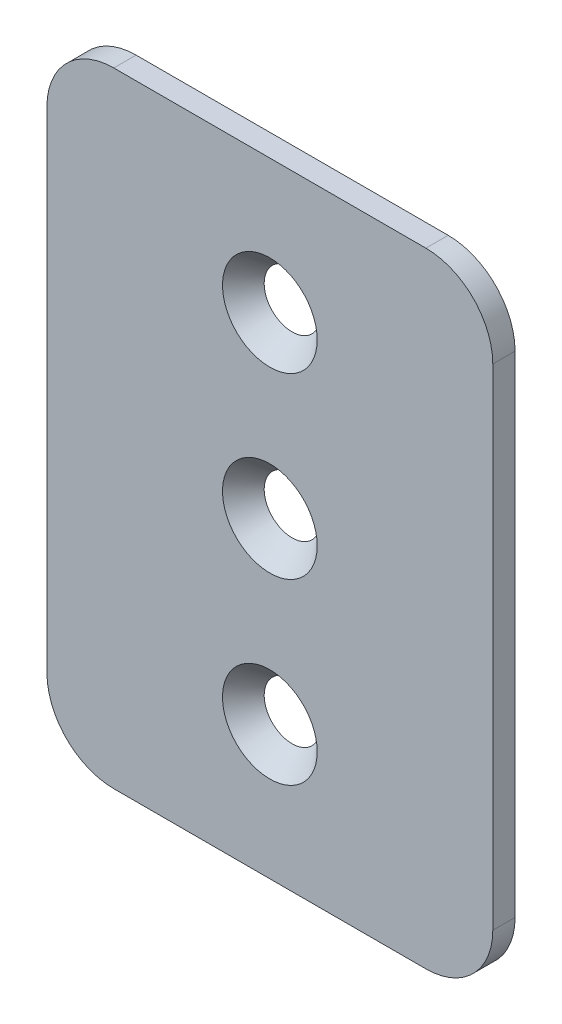
ISO-10303-21;
HEADER;
FILE_DESCRIPTION(('STEP AP214'),'2;1');
FILE_NAME('part.step','',(''),(''),'','','');
FILE_SCHEMA(('AUTOMOTIVE_DESIGN { 1 0 10303 214 1 1 1 1 }'));
ENDSEC;
DATA;
#1=APPLICATION_CONTEXT('core data for automotive mechanical design processes');
#2=APPLICATION_PROTOCOL_DEFINITION('international standard','automotive_design',2000,#1);
#3=PRODUCT_CONTEXT('',#1,'mechanical');
#4=PRODUCT('Part','Part','',(#3));
#5=PRODUCT_RELATED_PRODUCT_CATEGORY('part','',(#4));
#6=PRODUCT_DEFINITION_FORMATION('','',#4);
#7=PRODUCT_DEFINITION_CONTEXT('part definition',#1,'design');
#8=PRODUCT_DEFINITION('design','',#6,#7);
#9=PRODUCT_DEFINITION_SHAPE('','',#8);
#10=(LENGTH_UNIT() NAMED_UNIT(*) SI_UNIT(.MILLI.,.METRE.));
#11=(NAMED_UNIT(*) PLANE_ANGLE_UNIT() SI_UNIT($,.RADIAN.));
#12=(NAMED_UNIT(*) SI_UNIT($,.STERADIAN.) SOLID_ANGLE_UNIT());
#13=UNCERTAINTY_MEASURE_WITH_UNIT(LENGTH_MEASURE(1.E-05),#10,'distance_accuracy_value','');
#14=(GEOMETRIC_REPRESENTATION_CONTEXT(3) GLOBAL_UNCERTAINTY_ASSIGNED_CONTEXT((#13)) GLOBAL_UNIT_ASSIGNED_CONTEXT((#10,
#11,#12)) REPRESENTATION_CONTEXT('',''));
#15=CARTESIAN_POINT('',(0.,0.,0.));
#16=DIRECTION('',(0.,0.,1.));
#17=DIRECTION('',(1.,0.,0.));
#18=AXIS2_PLACEMENT_3D('',#15,#16,#17);
#19=CARTESIAN_POINT('',(22.225,34.925,0.));
#20=DIRECTION('',(0.,0.,-1.));
#21=DIRECTION('',(-1.,0.,0.));
#22=AXIS2_PLACEMENT_3D('',#19,#20,#21);
#23=PLANE('',#22);
#24=CARTESIAN_POINT('',(0.,25.4,0.));
#25=DIRECTION('',(0.,0.,-1.));
#26=DIRECTION('',(-1.,0.,0.));
#27=AXIS2_PLACEMENT_3D('',#24,#25,#26);
#28=CIRCLE('',#27,3.98371460743348);
#29=CARTESIAN_POINT('',(-3.98371460743349,25.4,0.));
#30=VERTEX_POINT('',#29);
#31=EDGE_CURVE('E226',#30,#30,#28,.T.);
#32=ORIENTED_EDGE('',*,*,#31,.F.);
#33=EDGE_LOOP('',(#32));
#34=FACE_BOUND('',#33,.T.);
#35=CARTESIAN_POINT('',(0.,-25.4,0.));
#36=DIRECTION('',(0.,0.,-1.));
#37=DIRECTION('',(-1.,0.,0.));
#38=AXIS2_PLACEMENT_3D('',#35,#36,#37);
#39=CIRCLE('',#38,3.98371460743348);
#40=CARTESIAN_POINT('',(-3.98371460743347,-25.4,0.));
#41=VERTEX_POINT('',#40);
#42=EDGE_CURVE('E137',#41,#41,#39,.T.);
#43=ORIENTED_EDGE('',*,*,#42,.F.);
#44=EDGE_LOOP('',(#43));
#45=FACE_BOUND('',#44,.T.);
#46=CARTESIAN_POINT('',(22.225,34.925,0.));
#47=DIRECTION('',(0.,0.,1.));
#48=DIRECTION('',(-1.,0.,0.));
#49=AXIS2_PLACEMENT_3D('',#46,#47,#48);
#50=CIRCLE('',#49,9.525);
#51=CARTESIAN_POINT('',(31.75,34.925,0.));
#52=VERTEX_POINT('',#51);
#53=CARTESIAN_POINT('',(22.225,44.45,0.));
#54=VERTEX_POINT('',#53);
#55=EDGE_CURVE('E133',#52,#54,#50,.T.);
#56=ORIENTED_EDGE('',*,*,#55,.F.);
#57=DIRECTION('',(0.,1.,0.));
#58=VECTOR('',#57,1.);
#59=CARTESIAN_POINT('',(31.75,34.925,0.));
#60=LINE('',#59,#58);
#61=CARTESIAN_POINT('',(31.75,-34.925,0.));
#62=VERTEX_POINT('',#61);
#63=EDGE_CURVE('E87',#62,#52,#60,.T.);
#64=ORIENTED_EDGE('',*,*,#63,.F.);
#65=CARTESIAN_POINT('',(22.225,-34.925,0.));
#66=DIRECTION('',(0.,0.,1.));
#67=DIRECTION('',(1.,0.,0.));
#68=AXIS2_PLACEMENT_3D('',#65,#66,#67);
#69=CIRCLE('',#68,9.525);
#70=CARTESIAN_POINT('',(22.225,-44.45,0.));
#71=VERTEX_POINT('',#70);
#72=EDGE_CURVE('E81',#71,#62,#69,.T.);
#73=ORIENTED_EDGE('',*,*,#72,.F.);
#74=DIRECTION('',(1.,0.,0.));
#75=VECTOR('',#74,1.);
#76=CARTESIAN_POINT('',(-22.225,-44.45,0.));
#77=LINE('',#76,#75);
#78=CARTESIAN_POINT('',(-22.225,-44.45,0.));
#79=VERTEX_POINT('',#78);
#80=EDGE_CURVE('E123',#79,#71,#77,.T.);
#81=ORIENTED_EDGE('',*,*,#80,.F.);
#82=CARTESIAN_POINT('',(-22.225,-34.925,0.));
#83=DIRECTION('',(0.,0.,1.));
#84=DIRECTION('',(1.,0.,0.));
#85=AXIS2_PLACEMENT_3D('',#82,#83,#84);
#86=CIRCLE('',#85,9.525);
#87=CARTESIAN_POINT('',(-31.75,-34.925,0.));
#88=VERTEX_POINT('',#87);
#89=EDGE_CURVE('E143',#88,#79,#86,.T.);
#90=ORIENTED_EDGE('',*,*,#89,.F.);
#91=DIRECTION('',(0.,-1.,0.));
#92=VECTOR('',#91,1.);
#93=CARTESIAN_POINT('',(-31.75,34.925,0.));
#94=LINE('',#93,#92);
#95=CARTESIAN_POINT('',(-31.75,34.925,0.));
#96=VERTEX_POINT('',#95);
#97=EDGE_CURVE('E141',#96,#88,#94,.T.);
#98=ORIENTED_EDGE('',*,*,#97,.F.);
#99=CARTESIAN_POINT('',(-22.225,34.925,0.));
#100=DIRECTION('',(0.,0.,1.));
#101=DIRECTION('',(1.,0.,0.));
#102=AXIS2_PLACEMENT_3D('',#99,#100,#101);
#103=CIRCLE('',#102,9.525);
#104=CARTESIAN_POINT('',(-22.225,44.45,0.));
#105=VERTEX_POINT('',#104);
#106=EDGE_CURVE('E139',#105,#96,#103,.T.);
#107=ORIENTED_EDGE('',*,*,#106,.F.);
#108=DIRECTION('',(-1.,0.,0.));
#109=VECTOR('',#108,1.);
#110=CARTESIAN_POINT('',(-22.225,44.45,0.));
#111=LINE('',#110,#109);
#112=EDGE_CURVE('E136',#54,#105,#111,.T.);
#113=ORIENTED_EDGE('',*,*,#112,.F.);
#114=EDGE_LOOP('',(#56,#64,#73,#81,#90,#98,#107,#113));
#115=FACE_BOUND('',#114,.T.);
#116=CARTESIAN_POINT('',(0.,0.,0.));
#117=DIRECTION('',(0.,0.,-1.));
#118=DIRECTION('',(-1.,0.,0.));
#119=AXIS2_PLACEMENT_3D('',#116,#117,#118);
#120=CIRCLE('',#119,3.98371460743348);
#121=CARTESIAN_POINT('',(-3.98371460743347,0.,0.));
#122=VERTEX_POINT('',#121);
#123=EDGE_CURVE('E37',#122,#122,#120,.T.);
#124=ORIENTED_EDGE('',*,*,#123,.F.);
#125=EDGE_LOOP('',(#124));
#126=FACE_BOUND('',#125,.T.);
#127=ADVANCED_FACE('F33',(#34,#45,#115,#126),#23,.T.);
#128=CARTESIAN_POINT('',(22.225,34.925,3.175));
#129=DIRECTION('',(0.,0.,-1.));
#130=DIRECTION('',(-1.,0.,0.));
#131=AXIS2_PLACEMENT_3D('',#128,#129,#130);
#132=PLANE('',#131);
#133=CARTESIAN_POINT('',(0.,25.4,3.175));
#134=DIRECTION('',(0.,0.,1.));
#135=DIRECTION('',(1.,0.,0.));
#136=AXIS2_PLACEMENT_3D('',#133,#134,#135);
#137=CIRCLE('',#136,6.7437);
#138=CARTESIAN_POINT('',(6.74369999999999,25.4,3.175));
#139=VERTEX_POINT('',#138);
#140=EDGE_CURVE('E229',#139,#139,#137,.T.);
#141=ORIENTED_EDGE('',*,*,#140,.F.);
#142=EDGE_LOOP('',(#141));
#143=FACE_BOUND('',#142,.T.);
#144=CARTESIAN_POINT('',(0.,0.,3.175));
#145=DIRECTION('',(0.,0.,1.));
#146=DIRECTION('',(1.,0.,0.));
#147=AXIS2_PLACEMENT_3D('',#144,#145,#146);
#148=CIRCLE('',#147,6.7437);
#149=CARTESIAN_POINT('',(6.74370000000001,0.,3.175));
#150=VERTEX_POINT('',#149);
#151=EDGE_CURVE('E168',#150,#150,#148,.T.);
#152=ORIENTED_EDGE('',*,*,#151,.F.);
#153=EDGE_LOOP('',(#152));
#154=FACE_BOUND('',#153,.T.);
#155=CARTESIAN_POINT('',(22.225,34.925,3.175));
#156=DIRECTION('',(0.,0.,1.));
#157=DIRECTION('',(-1.,0.,0.));
#158=AXIS2_PLACEMENT_3D('',#155,#156,#157);
#159=CIRCLE('',#158,9.525);
#160=CARTESIAN_POINT('',(31.75,34.925,3.175));
#161=VERTEX_POINT('',#160);
#162=CARTESIAN_POINT('',(22.225,44.45,3.175));
#163=VERTEX_POINT('',#162);
#164=EDGE_CURVE('E148',#161,#163,#159,.T.);
#165=ORIENTED_EDGE('',*,*,#164,.T.);
#166=DIRECTION('',(-1.,0.,0.));
#167=VECTOR('',#166,1.);
#168=CARTESIAN_POINT('',(-22.225,44.45,3.175));
#169=LINE('',#168,#167);
#170=CARTESIAN_POINT('',(-22.225,44.45,3.175));
#171=VERTEX_POINT('',#170);
#172=EDGE_CURVE('E95',#163,#171,#169,.T.);
#173=ORIENTED_EDGE('',*,*,#172,.T.);
#174=CARTESIAN_POINT('',(-22.225,34.925,3.175));
#175=DIRECTION('',(0.,0.,1.));
#176=DIRECTION('',(1.,0.,0.));
#177=AXIS2_PLACEMENT_3D('',#174,#175,#176);
#178=CIRCLE('',#177,9.525);
#179=CARTESIAN_POINT('',(-31.75,34.925,3.175));
#180=VERTEX_POINT('',#179);
#181=EDGE_CURVE('E174',#171,#180,#178,.T.);
#182=ORIENTED_EDGE('',*,*,#181,.T.);
#183=DIRECTION('',(0.,-1.,0.));
#184=VECTOR('',#183,1.);
#185=CARTESIAN_POINT('',(-31.75,34.925,3.175));
#186=LINE('',#185,#184);
#187=CARTESIAN_POINT('',(-31.75,-34.925,3.175));
#188=VERTEX_POINT('',#187);
#189=EDGE_CURVE('E176',#180,#188,#186,.T.);
#190=ORIENTED_EDGE('',*,*,#189,.T.);
#191=CARTESIAN_POINT('',(-22.225,-34.925,3.175));
#192=DIRECTION('',(0.,0.,1.));
#193=DIRECTION('',(1.,0.,0.));
#194=AXIS2_PLACEMENT_3D('',#191,#192,#193);
#195=CIRCLE('',#194,9.525);
#196=CARTESIAN_POINT('',(-22.225,-44.45,3.175));
#197=VERTEX_POINT('',#196);
#198=EDGE_CURVE('E115',#188,#197,#195,.T.);
#199=ORIENTED_EDGE('',*,*,#198,.T.);
#200=DIRECTION('',(1.,0.,0.));
#201=VECTOR('',#200,1.);
#202=CARTESIAN_POINT('',(-22.225,-44.45,3.175));
#203=LINE('',#202,#201);
#204=CARTESIAN_POINT('',(22.225,-44.45,3.175));
#205=VERTEX_POINT('',#204);
#206=EDGE_CURVE('E108',#197,#205,#203,.T.);
#207=ORIENTED_EDGE('',*,*,#206,.T.);
#208=CARTESIAN_POINT('',(22.225,-34.925,3.175));
#209=DIRECTION('',(0.,0.,1.));
#210=DIRECTION('',(1.,0.,0.));
#211=AXIS2_PLACEMENT_3D('',#208,#209,#210);
#212=CIRCLE('',#211,9.525);
#213=CARTESIAN_POINT('',(31.75,-34.925,3.175));
#214=VERTEX_POINT('',#213);
#215=EDGE_CURVE('E113',#205,#214,#212,.T.);
#216=ORIENTED_EDGE('',*,*,#215,.T.);
#217=DIRECTION('',(0.,1.,0.));
#218=VECTOR('',#217,1.);
#219=CARTESIAN_POINT('',(31.75,34.925,3.175));
#220=LINE('',#219,#218);
#221=EDGE_CURVE('E52',#214,#161,#220,.T.);
#222=ORIENTED_EDGE('',*,*,#221,.T.);
#223=EDGE_LOOP('',(#165,#173,#182,#190,#199,#207,#216,#222));
#224=FACE_BOUND('',#223,.T.);
#225=CARTESIAN_POINT('',(0.,-25.4,3.175));
#226=DIRECTION('',(0.,0.,1.));
#227=DIRECTION('',(1.,0.,0.));
#228=AXIS2_PLACEMENT_3D('',#225,#226,#227);
#229=CIRCLE('',#228,6.7437);
#230=CARTESIAN_POINT('',(6.74370000000001,-25.4,3.175));
#231=VERTEX_POINT('',#230);
#232=EDGE_CURVE('E160',#231,#231,#229,.T.);
#233=ORIENTED_EDGE('',*,*,#232,.F.);
#234=EDGE_LOOP('',(#233));
#235=FACE_BOUND('',#234,.T.);
#236=ADVANCED_FACE('F110',(#143,#154,#224,#235),#132,.F.);
#237=CARTESIAN_POINT('',(22.225,34.925,3.175));
#238=DIRECTION('',(0.,0.,-1.));
#239=DIRECTION('',(-1.,0.,0.));
#240=AXIS2_PLACEMENT_3D('',#237,#238,#239);
#241=CYLINDRICAL_SURFACE('',#240,9.525);
#242=ORIENTED_EDGE('',*,*,#55,.T.);
#243=DIRECTION('',(0.,0.,-1.));
#244=VECTOR('',#243,1.);
#245=CARTESIAN_POINT('',(22.225,44.45,3.175));
#246=LINE('',#245,#244);
#247=EDGE_CURVE('E11',#163,#54,#246,.T.);
#248=ORIENTED_EDGE('',*,*,#247,.F.);
#249=ORIENTED_EDGE('',*,*,#164,.F.);
#250=DIRECTION('',(0.,0.,-1.));
#251=VECTOR('',#250,1.);
#252=CARTESIAN_POINT('',(31.75,34.925,3.175));
#253=LINE('',#252,#251);
#254=EDGE_CURVE('E129',#161,#52,#253,.T.);
#255=ORIENTED_EDGE('',*,*,#254,.T.);
#256=EDGE_LOOP('',(#242,#248,#249,#255));
#257=FACE_BOUND('',#256,.T.);
#258=ADVANCED_FACE('F35',(#257),#241,.T.);
#259=CARTESIAN_POINT('',(-22.225,44.45,3.175));
#260=DIRECTION('',(0.,-1.,0.));
#261=DIRECTION('',(0.,0.,-1.));
#262=AXIS2_PLACEMENT_3D('',#259,#260,#261);
#263=PLANE('',#262);
#264=ORIENTED_EDGE('',*,*,#112,.T.);
#265=DIRECTION('',(0.,0.,-1.));
#266=VECTOR('',#265,1.);
#267=CARTESIAN_POINT('',(-22.225,44.45,3.175));
#268=LINE('',#267,#266);
#269=EDGE_CURVE('E43',#171,#105,#268,.T.);
#270=ORIENTED_EDGE('',*,*,#269,.F.);
#271=ORIENTED_EDGE('',*,*,#172,.F.);
#272=ORIENTED_EDGE('',*,*,#247,.T.);
#273=EDGE_LOOP('',(#264,#270,#271,#272));
#274=FACE_BOUND('',#273,.T.);
#275=ADVANCED_FACE('F298',(#274),#263,.F.);
#276=CARTESIAN_POINT('',(-22.225,34.925,3.175));
#277=DIRECTION('',(0.,0.,-1.));
#278=DIRECTION('',(-1.,0.,0.));
#279=AXIS2_PLACEMENT_3D('',#276,#277,#278);
#280=CYLINDRICAL_SURFACE('',#279,9.525);
#281=ORIENTED_EDGE('',*,*,#106,.T.);
#282=DIRECTION('',(0.,0.,-1.));
#283=VECTOR('',#282,1.);
#284=CARTESIAN_POINT('',(-31.75,34.925,3.175));
#285=LINE('',#284,#283);
#286=EDGE_CURVE('E155',#180,#96,#285,.T.);
#287=ORIENTED_EDGE('',*,*,#286,.F.);
#288=ORIENTED_EDGE('',*,*,#181,.F.);
#289=ORIENTED_EDGE('',*,*,#269,.T.);
#290=EDGE_LOOP('',(#281,#287,#288,#289));
#291=FACE_BOUND('',#290,.T.);
#292=ADVANCED_FACE('F289',(#291),#280,.T.);
#293=CARTESIAN_POINT('',(-31.75,34.925,3.175));
#294=DIRECTION('',(1.,0.,0.));
#295=DIRECTION('',(0.,0.,-1.));
#296=AXIS2_PLACEMENT_3D('',#293,#294,#295);
#297=PLANE('',#296);
#298=ORIENTED_EDGE('',*,*,#97,.T.);
#299=DIRECTION('',(0.,0.,-1.));
#300=VECTOR('',#299,1.);
#301=CARTESIAN_POINT('',(-31.75,-34.925,3.175));
#302=LINE('',#301,#300);
#303=EDGE_CURVE('E152',#188,#88,#302,.T.);
#304=ORIENTED_EDGE('',*,*,#303,.F.);
#305=ORIENTED_EDGE('',*,*,#189,.F.);
#306=ORIENTED_EDGE('',*,*,#286,.T.);
#307=EDGE_LOOP('',(#298,#304,#305,#306));
#308=FACE_BOUND('',#307,.T.);
#309=ADVANCED_FACE('F182',(#308),#297,.F.);
#310=CARTESIAN_POINT('',(-22.225,-34.925,3.175));
#311=DIRECTION('',(0.,0.,-1.));
#312=DIRECTION('',(-1.,0.,0.));
#313=AXIS2_PLACEMENT_3D('',#310,#311,#312);
#314=CYLINDRICAL_SURFACE('',#313,9.525);
#315=ORIENTED_EDGE('',*,*,#89,.T.);
#316=DIRECTION('',(0.,0.,-1.));
#317=VECTOR('',#316,1.);
#318=CARTESIAN_POINT('',(-22.225,-44.45,3.175));
#319=LINE('',#318,#317);
#320=EDGE_CURVE('E124',#197,#79,#319,.T.);
#321=ORIENTED_EDGE('',*,*,#320,.F.);
#322=ORIENTED_EDGE('',*,*,#198,.F.);
#323=ORIENTED_EDGE('',*,*,#303,.T.);
#324=EDGE_LOOP('',(#315,#321,#322,#323));
#325=FACE_BOUND('',#324,.T.);
#326=ADVANCED_FACE('F186',(#325),#314,.T.);
#327=CARTESIAN_POINT('',(-22.225,-44.45,3.175));
#328=DIRECTION('',(0.,1.,0.));
#329=DIRECTION('',(0.,0.,1.));
#330=AXIS2_PLACEMENT_3D('',#327,#328,#329);
#331=PLANE('',#330);
#332=ORIENTED_EDGE('',*,*,#80,.T.);
#333=DIRECTION('',(0.,0.,-1.));
#334=VECTOR('',#333,1.);
#335=CARTESIAN_POINT('',(22.225,-44.45,3.175));
#336=LINE('',#335,#334);
#337=EDGE_CURVE('E120',#205,#71,#336,.T.);
#338=ORIENTED_EDGE('',*,*,#337,.F.);
#339=ORIENTED_EDGE('',*,*,#206,.F.);
#340=ORIENTED_EDGE('',*,*,#320,.T.);
#341=EDGE_LOOP('',(#332,#338,#339,#340));
#342=FACE_BOUND('',#341,.T.);
#343=ADVANCED_FACE('F121',(#342),#331,.F.);
#344=CARTESIAN_POINT('',(22.225,-34.925,3.175));
#345=DIRECTION('',(0.,0.,-1.));
#346=DIRECTION('',(-1.,0.,0.));
#347=AXIS2_PLACEMENT_3D('',#344,#345,#346);
#348=CYLINDRICAL_SURFACE('',#347,9.525);
#349=ORIENTED_EDGE('',*,*,#72,.T.);
#350=DIRECTION('',(0.,0.,-1.));
#351=VECTOR('',#350,1.);
#352=CARTESIAN_POINT('',(31.75,-34.925,3.175));
#353=LINE('',#352,#351);
#354=EDGE_CURVE('E125',#214,#62,#353,.T.);
#355=ORIENTED_EDGE('',*,*,#354,.F.);
#356=ORIENTED_EDGE('',*,*,#215,.F.);
#357=ORIENTED_EDGE('',*,*,#337,.T.);
#358=EDGE_LOOP('',(#349,#355,#356,#357));
#359=FACE_BOUND('',#358,.T.);
#360=ADVANCED_FACE('F127',(#359),#348,.T.);
#361=CARTESIAN_POINT('',(31.75,34.925,3.175));
#362=DIRECTION('',(-1.,0.,0.));
#363=DIRECTION('',(0.,0.,1.));
#364=AXIS2_PLACEMENT_3D('',#361,#362,#363);
#365=PLANE('',#364);
#366=ORIENTED_EDGE('',*,*,#63,.T.);
#367=ORIENTED_EDGE('',*,*,#254,.F.);
#368=ORIENTED_EDGE('',*,*,#221,.F.);
#369=ORIENTED_EDGE('',*,*,#354,.T.);
#370=EDGE_LOOP('',(#366,#367,#368,#369));
#371=FACE_BOUND('',#370,.T.);
#372=ADVANCED_FACE('F194',(#371),#365,.F.);
#373=CARTESIAN_POINT('',(0.,-25.4,3.175));
#374=DIRECTION('',(0.,0.,1.));
#375=DIRECTION('',(1.,0.,0.));
#376=AXIS2_PLACEMENT_3D('',#373,#374,#375);
#377=CONICAL_SURFACE('',#376,6.7437,0.715584993317676);
#378=ORIENTED_EDGE('',*,*,#42,.T.);
#379=EDGE_LOOP('',(#378));
#380=FACE_BOUND('',#379,.T.);
#381=ORIENTED_EDGE('',*,*,#232,.T.);
#382=EDGE_LOOP('',(#381));
#383=FACE_BOUND('',#382,.T.);
#384=ADVANCED_FACE('F196',(#380,#383),#377,.F.);
#385=CARTESIAN_POINT('',(0.,0.,3.175));
#386=DIRECTION('',(0.,0.,1.));
#387=DIRECTION('',(1.,0.,0.));
#388=AXIS2_PLACEMENT_3D('',#385,#386,#387);
#389=CONICAL_SURFACE('',#388,6.7437,0.715584993317676);
#390=ORIENTED_EDGE('',*,*,#123,.T.);
#391=EDGE_LOOP('',(#390));
#392=FACE_BOUND('',#391,.T.);
#393=ORIENTED_EDGE('',*,*,#151,.T.);
#394=EDGE_LOOP('',(#393));
#395=FACE_BOUND('',#394,.T.);
#396=ADVANCED_FACE('F202',(#392,#395),#389,.F.);
#397=CARTESIAN_POINT('',(0.,25.4,3.175));
#398=DIRECTION('',(0.,0.,1.));
#399=DIRECTION('',(1.,0.,0.));
#400=AXIS2_PLACEMENT_3D('',#397,#398,#399);
#401=CONICAL_SURFACE('',#400,6.7437,0.715584993317676);
#402=ORIENTED_EDGE('',*,*,#31,.T.);
#403=EDGE_LOOP('',(#402));
#404=FACE_BOUND('',#403,.T.);
#405=ORIENTED_EDGE('',*,*,#140,.T.);
#406=EDGE_LOOP('',(#405));
#407=FACE_BOUND('',#406,.T.);
#408=ADVANCED_FACE('F218',(#404,#407),#401,.F.);
#409=CLOSED_SHELL('',(#127,#236,#258,#275,#292,#309,#326,#343,#360,#372,#384,#396,#408));
#410=MANIFOLD_SOLID_BREP('B2',#409);
#411=ADVANCED_BREP_SHAPE_REPRESENTATION('',(#18,#410),#14);
#412=SHAPE_DEFINITION_REPRESENTATION(#9,#411);
ENDSEC;
END-ISO-10303-21;
